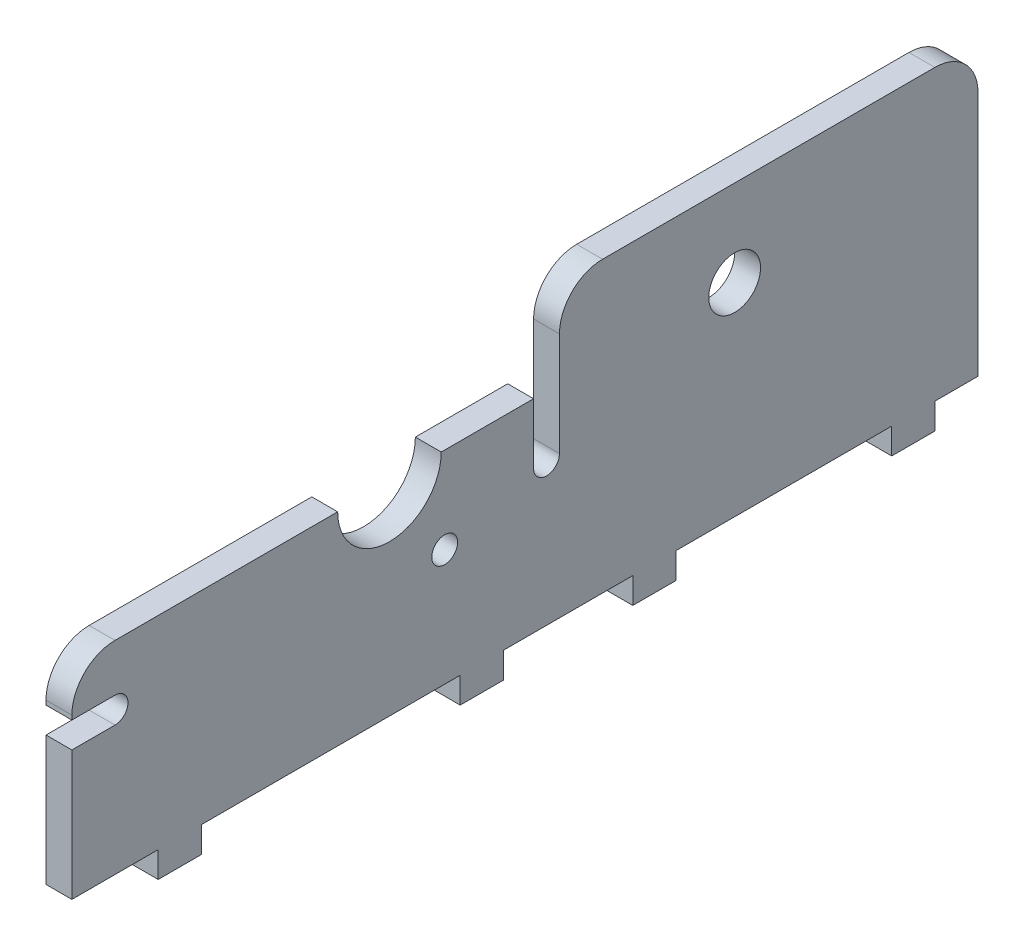
ISO-10303-21;
HEADER;
FILE_DESCRIPTION(('STEP AP214'),'2;1');
FILE_NAME('part.step','',(''),(''),'','','');
FILE_SCHEMA(('AUTOMOTIVE_DESIGN { 1 0 10303 214 1 1 1 1 }'));
ENDSEC;
DATA;
#1=APPLICATION_CONTEXT('core data for automotive mechanical design processes');
#2=APPLICATION_PROTOCOL_DEFINITION('international standard','automotive_design',2000,#1);
#3=PRODUCT_CONTEXT('',#1,'mechanical');
#4=PRODUCT('Part','Part','',(#3));
#5=PRODUCT_RELATED_PRODUCT_CATEGORY('part','',(#4));
#6=PRODUCT_DEFINITION_FORMATION('','',#4);
#7=PRODUCT_DEFINITION_CONTEXT('part definition',#1,'design');
#8=PRODUCT_DEFINITION('design','',#6,#7);
#9=PRODUCT_DEFINITION_SHAPE('','',#8);
#10=(LENGTH_UNIT() NAMED_UNIT(*) SI_UNIT(.MILLI.,.METRE.));
#11=(NAMED_UNIT(*) PLANE_ANGLE_UNIT() SI_UNIT($,.RADIAN.));
#12=(NAMED_UNIT(*) SI_UNIT($,.STERADIAN.) SOLID_ANGLE_UNIT());
#13=UNCERTAINTY_MEASURE_WITH_UNIT(LENGTH_MEASURE(1.E-05),#10,'distance_accuracy_value','');
#14=(GEOMETRIC_REPRESENTATION_CONTEXT(3) GLOBAL_UNCERTAINTY_ASSIGNED_CONTEXT((#13)) GLOBAL_UNIT_ASSIGNED_CONTEXT((#10,
#11,#12)) REPRESENTATION_CONTEXT('',''));
#15=CARTESIAN_POINT('',(0.,0.,0.));
#16=DIRECTION('',(0.,0.,1.));
#17=DIRECTION('',(1.,0.,0.));
#18=AXIS2_PLACEMENT_3D('',#15,#16,#17);
#19=CARTESIAN_POINT('',(3.,0.,-75.));
#20=DIRECTION('',(0.,1.,0.));
#21=DIRECTION('',(0.,0.,1.));
#22=AXIS2_PLACEMENT_3D('',#19,#20,#21);
#23=PLANE('',#22);
#24=DIRECTION('',(1.,0.,0.));
#25=VECTOR('',#24,1.);
#26=CARTESIAN_POINT('',(0.,0.,-70.));
#27=LINE('',#26,#25);
#28=CARTESIAN_POINT('',(0.,0.,-70.));
#29=VERTEX_POINT('',#28);
#30=CARTESIAN_POINT('',(3.,0.,-70.));
#31=VERTEX_POINT('',#30);
#32=EDGE_CURVE('E547',#29,#31,#27,.T.);
#33=ORIENTED_EDGE('',*,*,#32,.F.);
#34=DIRECTION('',(0.,0.,-1.));
#35=VECTOR('',#34,1.);
#36=CARTESIAN_POINT('',(0.,0.,-75.));
#37=LINE('',#36,#35);
#38=CARTESIAN_POINT('',(0.,0.,-75.));
#39=VERTEX_POINT('',#38);
#40=EDGE_CURVE('E279',#29,#39,#37,.T.);
#41=ORIENTED_EDGE('',*,*,#40,.T.);
#42=DIRECTION('',(-1.,0.,0.));
#43=VECTOR('',#42,1.);
#44=CARTESIAN_POINT('',(3.,0.,-75.));
#45=LINE('',#44,#43);
#46=CARTESIAN_POINT('',(3.,0.,-75.));
#47=VERTEX_POINT('',#46);
#48=EDGE_CURVE('E449',#47,#39,#45,.T.);
#49=ORIENTED_EDGE('',*,*,#48,.F.);
#50=DIRECTION('',(0.,0.,-1.));
#51=VECTOR('',#50,1.);
#52=CARTESIAN_POINT('',(3.,0.,-75.));
#53=LINE('',#52,#51);
#54=EDGE_CURVE('E437',#31,#47,#53,.T.);
#55=ORIENTED_EDGE('',*,*,#54,.F.);
#56=EDGE_LOOP('',(#33,#41,#49,#55));
#57=FACE_BOUND('',#56,.T.);
#58=ADVANCED_FACE('F39',(#57),#23,.F.);
#59=DIRECTION('',(-1.,0.,0.));
#60=VECTOR('',#59,1.);
#61=CARTESIAN_POINT('',(0.,0.,-65.));
#62=LINE('',#61,#60);
#63=CARTESIAN_POINT('',(3.,0.,-65.));
#64=VERTEX_POINT('',#63);
#65=CARTESIAN_POINT('',(0.,0.,-65.));
#66=VERTEX_POINT('',#65);
#67=EDGE_CURVE('E274',#64,#66,#62,.T.);
#68=ORIENTED_EDGE('',*,*,#67,.F.);
#69=CARTESIAN_POINT('',(3.,0.,-40.));
#70=VERTEX_POINT('',#69);
#71=EDGE_CURVE('E577',#70,#64,#53,.T.);
#72=ORIENTED_EDGE('',*,*,#71,.F.);
#73=DIRECTION('',(1.,0.,0.));
#74=VECTOR('',#73,1.);
#75=CARTESIAN_POINT('',(0.,0.,-40.));
#76=LINE('',#75,#74);
#77=CARTESIAN_POINT('',(0.,0.,-40.));
#78=VERTEX_POINT('',#77);
#79=EDGE_CURVE('E281',#78,#70,#76,.T.);
#80=ORIENTED_EDGE('',*,*,#79,.F.);
#81=EDGE_CURVE('E539',#78,#66,#37,.T.);
#82=ORIENTED_EDGE('',*,*,#81,.T.);
#83=EDGE_LOOP('',(#68,#72,#80,#82));
#84=FACE_BOUND('',#83,.T.);
#85=ADVANCED_FACE('F594',(#84),#23,.F.);
#86=DIRECTION('',(-1.,0.,0.));
#87=VECTOR('',#86,1.);
#88=CARTESIAN_POINT('',(0.,0.,-35.));
#89=LINE('',#88,#87);
#90=CARTESIAN_POINT('',(3.,0.,-35.));
#91=VERTEX_POINT('',#90);
#92=CARTESIAN_POINT('',(0.,0.,-35.));
#93=VERTEX_POINT('',#92);
#94=EDGE_CURVE('E284',#91,#93,#89,.T.);
#95=ORIENTED_EDGE('',*,*,#94,.F.);
#96=CARTESIAN_POINT('',(3.,0.,-20.));
#97=VERTEX_POINT('',#96);
#98=EDGE_CURVE('E580',#97,#91,#53,.T.);
#99=ORIENTED_EDGE('',*,*,#98,.F.);
#100=DIRECTION('',(-1.,0.,0.));
#101=VECTOR('',#100,1.);
#102=CARTESIAN_POINT('',(3.,0.,-20.));
#103=LINE('',#102,#101);
#104=CARTESIAN_POINT('',(0.,0.,-20.));
#105=VERTEX_POINT('',#104);
#106=EDGE_CURVE('E341',#97,#105,#103,.T.);
#107=ORIENTED_EDGE('',*,*,#106,.T.);
#108=EDGE_CURVE('E538',#105,#93,#37,.T.);
#109=ORIENTED_EDGE('',*,*,#108,.T.);
#110=EDGE_LOOP('',(#95,#99,#107,#109));
#111=FACE_BOUND('',#110,.T.);
#112=ADVANCED_FACE('F596',(#111),#23,.F.);
#113=CARTESIAN_POINT('',(3.,23.5,-75.));
#114=DIRECTION('',(0.,-1.,0.));
#115=DIRECTION('',(0.,0.,-1.));
#116=AXIS2_PLACEMENT_3D('',#113,#114,#115);
#117=PLANE('',#116);
#118=DIRECTION('',(0.,0.,1.));
#119=VECTOR('',#118,1.);
#120=CARTESIAN_POINT('',(3.,23.5,-75.));
#121=LINE('',#120,#119);
#122=CARTESIAN_POINT('',(3.,23.5,-23.5));
#123=VERTEX_POINT('',#122);
#124=CARTESIAN_POINT('',(3.,23.5,-12.8));
#125=VERTEX_POINT('',#124);
#126=EDGE_CURVE('E447',#123,#125,#121,.T.);
#127=ORIENTED_EDGE('',*,*,#126,.F.);
#128=DIRECTION('',(1.,0.,0.));
#129=VECTOR('',#128,1.);
#130=CARTESIAN_POINT('',(0.,23.5,-23.5));
#131=LINE('',#130,#129);
#132=CARTESIAN_POINT('',(0.,23.5,-23.5));
#133=VERTEX_POINT('',#132);
#134=EDGE_CURVE('E334',#133,#123,#131,.T.);
#135=ORIENTED_EDGE('',*,*,#134,.F.);
#136=DIRECTION('',(0.,0.,1.));
#137=VECTOR('',#136,1.);
#138=CARTESIAN_POINT('',(0.,23.5,-75.));
#139=LINE('',#138,#137);
#140=CARTESIAN_POINT('',(0.,23.5,-12.8));
#141=VERTEX_POINT('',#140);
#142=EDGE_CURVE('E459',#133,#141,#139,.T.);
#143=ORIENTED_EDGE('',*,*,#142,.T.);
#144=DIRECTION('',(1.,0.,0.));
#145=VECTOR('',#144,1.);
#146=CARTESIAN_POINT('',(0.,23.5,-12.8));
#147=LINE('',#146,#145);
#148=EDGE_CURVE('E431',#141,#125,#147,.T.);
#149=ORIENTED_EDGE('',*,*,#148,.T.);
#150=EDGE_LOOP('',(#127,#135,#143,#149));
#151=FACE_BOUND('',#150,.T.);
#152=ADVANCED_FACE('F602',(#151),#117,.F.);
#153=CARTESIAN_POINT('',(0.,0.,15.));
#154=VERTEX_POINT('',#153);
#155=CARTESIAN_POINT('',(0.,0.,-15.));
#156=VERTEX_POINT('',#155);
#157=EDGE_CURVE('E455',#154,#156,#37,.T.);
#158=ORIENTED_EDGE('',*,*,#157,.T.);
#159=DIRECTION('',(1.,0.,0.));
#160=VECTOR('',#159,1.);
#161=CARTESIAN_POINT('',(3.,0.,-15.));
#162=LINE('',#161,#160);
#163=CARTESIAN_POINT('',(3.,0.,-15.));
#164=VERTEX_POINT('',#163);
#165=EDGE_CURVE('E333',#156,#164,#162,.T.);
#166=ORIENTED_EDGE('',*,*,#165,.T.);
#167=CARTESIAN_POINT('',(3.,0.,15.));
#168=VERTEX_POINT('',#167);
#169=EDGE_CURVE('E443',#168,#164,#53,.T.);
#170=ORIENTED_EDGE('',*,*,#169,.F.);
#171=DIRECTION('',(1.,0.,0.));
#172=VECTOR('',#171,1.);
#173=CARTESIAN_POINT('',(3.,0.,15.));
#174=LINE('',#173,#172);
#175=EDGE_CURVE('E370',#154,#168,#174,.T.);
#176=ORIENTED_EDGE('',*,*,#175,.F.);
#177=EDGE_LOOP('',(#158,#166,#170,#176));
#178=FACE_BOUND('',#177,.T.);
#179=ADVANCED_FACE('F536',(#178),#23,.F.);
#180=DIRECTION('',(-1.,0.,0.));
#181=VECTOR('',#180,1.);
#182=CARTESIAN_POINT('',(3.,0.,20.));
#183=LINE('',#182,#181);
#184=CARTESIAN_POINT('',(3.,0.,20.));
#185=VERTEX_POINT('',#184);
#186=CARTESIAN_POINT('',(0.,0.,20.));
#187=VERTEX_POINT('',#186);
#188=EDGE_CURVE('E365',#185,#187,#183,.T.);
#189=ORIENTED_EDGE('',*,*,#188,.F.);
#190=CARTESIAN_POINT('',(3.,0.,30.));
#191=VERTEX_POINT('',#190);
#192=EDGE_CURVE('E439',#191,#185,#53,.T.);
#193=ORIENTED_EDGE('',*,*,#192,.F.);
#194=DIRECTION('',(-1.,0.,0.));
#195=VECTOR('',#194,1.);
#196=CARTESIAN_POINT('',(3.,0.,30.));
#197=LINE('',#196,#195);
#198=CARTESIAN_POINT('',(0.,0.,30.));
#199=VERTEX_POINT('',#198);
#200=EDGE_CURVE('E463',#191,#199,#197,.T.);
#201=ORIENTED_EDGE('',*,*,#200,.T.);
#202=EDGE_CURVE('E452',#199,#187,#37,.T.);
#203=ORIENTED_EDGE('',*,*,#202,.T.);
#204=EDGE_LOOP('',(#189,#193,#201,#203));
#205=FACE_BOUND('',#204,.T.);
#206=ADVANCED_FACE('F521',(#205),#23,.F.);
#207=CARTESIAN_POINT('',(3.,0.,30.));
#208=DIRECTION('',(0.,0.,-1.));
#209=DIRECTION('',(-1.,0.,0.));
#210=AXIS2_PLACEMENT_3D('',#207,#208,#209);
#211=PLANE('',#210);
#212=DIRECTION('',(0.,-1.,0.));
#213=VECTOR('',#212,1.);
#214=CARTESIAN_POINT('',(3.,0.,30.));
#215=LINE('',#214,#213);
#216=CARTESIAN_POINT('',(3.,15.,30.));
#217=VERTEX_POINT('',#216);
#218=EDGE_CURVE('E438',#217,#191,#215,.T.);
#219=ORIENTED_EDGE('',*,*,#218,.F.);
#220=DIRECTION('',(1.,0.,0.));
#221=VECTOR('',#220,1.);
#222=CARTESIAN_POINT('',(0.,15.,30.));
#223=LINE('',#222,#221);
#224=CARTESIAN_POINT('',(0.,15.,30.));
#225=VERTEX_POINT('',#224);
#226=EDGE_CURVE('E414',#225,#217,#223,.T.);
#227=ORIENTED_EDGE('',*,*,#226,.F.);
#228=DIRECTION('',(0.,-1.,0.));
#229=VECTOR('',#228,1.);
#230=CARTESIAN_POINT('',(0.,0.,30.));
#231=LINE('',#230,#229);
#232=EDGE_CURVE('E434',#225,#199,#231,.T.);
#233=ORIENTED_EDGE('',*,*,#232,.T.);
#234=ORIENTED_EDGE('',*,*,#200,.F.);
#235=EDGE_LOOP('',(#219,#227,#233,#234));
#236=FACE_BOUND('',#235,.T.);
#237=ADVANCED_FACE('F514',(#236),#211,.F.);
#238=CARTESIAN_POINT('',(3.,18.5,30.));
#239=VERTEX_POINT('',#238);
#240=CARTESIAN_POINT('',(3.,18.,30.));
#241=VERTEX_POINT('',#240);
#242=EDGE_CURVE('E435',#239,#241,#215,.T.);
#243=ORIENTED_EDGE('',*,*,#242,.F.);
#244=DIRECTION('',(-1.,0.,0.));
#245=VECTOR('',#244,1.);
#246=CARTESIAN_POINT('',(3.,18.5,30.));
#247=LINE('',#246,#245);
#248=CARTESIAN_POINT('',(0.,18.5,30.));
#249=VERTEX_POINT('',#248);
#250=EDGE_CURVE('E47',#239,#249,#247,.T.);
#251=ORIENTED_EDGE('',*,*,#250,.T.);
#252=CARTESIAN_POINT('',(0.,18.,30.));
#253=VERTEX_POINT('',#252);
#254=EDGE_CURVE('E450',#249,#253,#231,.T.);
#255=ORIENTED_EDGE('',*,*,#254,.T.);
#256=DIRECTION('',(1.,0.,0.));
#257=VECTOR('',#256,1.);
#258=CARTESIAN_POINT('',(0.,18.,30.));
#259=LINE('',#258,#257);
#260=EDGE_CURVE('E416',#253,#241,#259,.T.);
#261=ORIENTED_EDGE('',*,*,#260,.T.);
#262=EDGE_LOOP('',(#243,#251,#255,#261));
#263=FACE_BOUND('',#262,.T.);
#264=ADVANCED_FACE('F492',(#263),#211,.F.);
#265=CARTESIAN_POINT('',(3.,0.,-75.));
#266=DIRECTION('',(0.,0.,1.));
#267=DIRECTION('',(1.,0.,0.));
#268=AXIS2_PLACEMENT_3D('',#265,#266,#267);
#269=PLANE('',#268);
#270=DIRECTION('',(0.,1.,0.));
#271=VECTOR('',#270,1.);
#272=CARTESIAN_POINT('',(0.,0.,-75.));
#273=LINE('',#272,#271);
#274=CARTESIAN_POINT('',(0.,28.5,-75.));
#275=VERTEX_POINT('',#274);
#276=EDGE_CURVE('E454',#39,#275,#273,.T.);
#277=ORIENTED_EDGE('',*,*,#276,.T.);
#278=DIRECTION('',(-1.,0.,0.));
#279=VECTOR('',#278,1.);
#280=CARTESIAN_POINT('',(3.,28.5,-75.));
#281=LINE('',#280,#279);
#282=CARTESIAN_POINT('',(3.,28.5,-75.));
#283=VERTEX_POINT('',#282);
#284=EDGE_CURVE('E481',#275,#283,#281,.F.);
#285=ORIENTED_EDGE('',*,*,#284,.T.);
#286=DIRECTION('',(0.,1.,0.));
#287=VECTOR('',#286,1.);
#288=CARTESIAN_POINT('',(3.,0.,-75.));
#289=LINE('',#288,#287);
#290=EDGE_CURVE('E442',#47,#283,#289,.T.);
#291=ORIENTED_EDGE('',*,*,#290,.F.);
#292=ORIENTED_EDGE('',*,*,#48,.T.);
#293=EDGE_LOOP('',(#277,#285,#291,#292));
#294=FACE_BOUND('',#293,.T.);
#295=ADVANCED_FACE('F549',(#294),#269,.F.);
#296=CARTESIAN_POINT('',(0.,23.5,-0.799999999999991));
#297=VERTEX_POINT('',#296);
#298=CARTESIAN_POINT('',(0.,23.5,25.));
#299=VERTEX_POINT('',#298);
#300=EDGE_CURVE('E458',#297,#299,#139,.T.);
#301=ORIENTED_EDGE('',*,*,#300,.T.);
#302=DIRECTION('',(-1.,0.,0.));
#303=VECTOR('',#302,1.);
#304=CARTESIAN_POINT('',(3.,23.5,25.));
#305=LINE('',#304,#303);
#306=CARTESIAN_POINT('',(3.,23.5,25.));
#307=VERTEX_POINT('',#306);
#308=EDGE_CURVE('E11',#299,#307,#305,.F.);
#309=ORIENTED_EDGE('',*,*,#308,.T.);
#310=CARTESIAN_POINT('',(3.,23.5,-0.799999999999991));
#311=VERTEX_POINT('',#310);
#312=EDGE_CURVE('E446',#311,#307,#121,.T.);
#313=ORIENTED_EDGE('',*,*,#312,.F.);
#314=DIRECTION('',(1.,0.,0.));
#315=VECTOR('',#314,1.);
#316=CARTESIAN_POINT('',(0.,23.5,-0.799999999999991));
#317=LINE('',#316,#315);
#318=EDGE_CURVE('E423',#311,#297,#317,.F.);
#319=ORIENTED_EDGE('',*,*,#318,.T.);
#320=EDGE_LOOP('',(#301,#309,#313,#319));
#321=FACE_BOUND('',#320,.T.);
#322=ADVANCED_FACE('F638',(#321),#117,.F.);
#323=CARTESIAN_POINT('',(3.,0.,0.));
#324=DIRECTION('',(1.,0.,0.));
#325=DIRECTION('',(0.,0.,-1.));
#326=AXIS2_PLACEMENT_3D('',#323,#324,#325);
#327=PLANE('',#326);
#328=CARTESIAN_POINT('',(3.,23.5,-46.8));
#329=DIRECTION('',(1.,0.,0.));
#330=DIRECTION('',(0.,0.,-1.));
#331=AXIS2_PLACEMENT_3D('',#328,#329,#330);
#332=CIRCLE('',#331,3.);
#333=CARTESIAN_POINT('',(3.,23.5,-49.8));
#334=VERTEX_POINT('',#333);
#335=EDGE_CURVE('E988',#334,#334,#332,.T.);
#336=ORIENTED_EDGE('',*,*,#335,.F.);
#337=EDGE_LOOP('',(#336));
#338=FACE_BOUND('',#337,.T.);
#339=ORIENTED_EDGE('',*,*,#290,.T.);
#340=CARTESIAN_POINT('',(3.,28.5,-70.));
#341=DIRECTION('',(1.,0.,0.));
#342=DIRECTION('',(0.,0.,-1.));
#343=AXIS2_PLACEMENT_3D('',#340,#341,#342);
#344=CIRCLE('',#343,5.);
#345=CARTESIAN_POINT('',(3.,33.5,-70.));
#346=VERTEX_POINT('',#345);
#347=EDGE_CURVE('E485',#283,#346,#344,.T.);
#348=ORIENTED_EDGE('',*,*,#347,.T.);
#349=DIRECTION('',(0.,0.,-1.));
#350=VECTOR('',#349,1.);
#351=CARTESIAN_POINT('',(3.,33.5,-26.5));
#352=LINE('',#351,#350);
#353=CARTESIAN_POINT('',(3.,33.5,-31.5));
#354=VERTEX_POINT('',#353);
#355=EDGE_CURVE('E561',#354,#346,#352,.T.);
#356=ORIENTED_EDGE('',*,*,#355,.F.);
#357=CARTESIAN_POINT('',(3.,28.5,-31.5));
#358=DIRECTION('',(1.,0.,0.));
#359=DIRECTION('',(0.,0.,-1.));
#360=AXIS2_PLACEMENT_3D('',#357,#358,#359);
#361=CIRCLE('',#360,5.);
#362=CARTESIAN_POINT('',(3.,28.5,-26.5));
#363=VERTEX_POINT('',#362);
#364=EDGE_CURVE('E54',#354,#363,#361,.T.);
#365=ORIENTED_EDGE('',*,*,#364,.T.);
#366=DIRECTION('',(0.,1.,0.));
#367=VECTOR('',#366,1.);
#368=CARTESIAN_POINT('',(3.,23.5,-26.5));
#369=LINE('',#368,#367);
#370=CARTESIAN_POINT('',(3.,16.5,-26.5));
#371=VERTEX_POINT('',#370);
#372=EDGE_CURVE('E327',#371,#363,#369,.T.);
#373=ORIENTED_EDGE('',*,*,#372,.F.);
#374=CARTESIAN_POINT('',(3.,16.5,-25.));
#375=DIRECTION('',(1.,0.,0.));
#376=DIRECTION('',(0.,0.,-1.));
#377=AXIS2_PLACEMENT_3D('',#374,#375,#376);
#378=CIRCLE('',#377,1.5);
#379=CARTESIAN_POINT('',(3.,16.5,-23.5));
#380=VERTEX_POINT('',#379);
#381=EDGE_CURVE('E313',#380,#371,#378,.T.);
#382=ORIENTED_EDGE('',*,*,#381,.F.);
#383=DIRECTION('',(0.,-1.,0.));
#384=VECTOR('',#383,1.);
#385=CARTESIAN_POINT('',(3.,16.5,-23.5));
#386=LINE('',#385,#384);
#387=EDGE_CURVE('E318',#123,#380,#386,.T.);
#388=ORIENTED_EDGE('',*,*,#387,.F.);
#389=ORIENTED_EDGE('',*,*,#126,.T.);
#390=CARTESIAN_POINT('',(3.,23.5,-6.79999999999999));
#391=DIRECTION('',(1.,0.,0.));
#392=DIRECTION('',(0.,0.,-1.));
#393=AXIS2_PLACEMENT_3D('',#390,#391,#392);
#394=CIRCLE('',#393,6.);
#395=EDGE_CURVE('E420',#311,#125,#394,.T.);
#396=ORIENTED_EDGE('',*,*,#395,.F.);
#397=ORIENTED_EDGE('',*,*,#312,.T.);
#398=CARTESIAN_POINT('',(3.,18.5,25.));
#399=DIRECTION('',(1.,0.,0.));
#400=DIRECTION('',(0.,0.,-1.));
#401=AXIS2_PLACEMENT_3D('',#398,#399,#400);
#402=CIRCLE('',#401,5.);
#403=EDGE_CURVE('E61',#307,#239,#402,.T.);
#404=ORIENTED_EDGE('',*,*,#403,.T.);
#405=ORIENTED_EDGE('',*,*,#242,.T.);
#406=DIRECTION('',(0.,0.,1.));
#407=VECTOR('',#406,1.);
#408=CARTESIAN_POINT('',(3.,18.,25.));
#409=LINE('',#408,#407);
#410=CARTESIAN_POINT('',(3.,18.,25.));
#411=VERTEX_POINT('',#410);
#412=EDGE_CURVE('E406',#411,#241,#409,.T.);
#413=ORIENTED_EDGE('',*,*,#412,.F.);
#414=CARTESIAN_POINT('',(3.,16.5,25.));
#415=DIRECTION('',(1.,0.,0.));
#416=DIRECTION('',(0.,0.,-1.));
#417=AXIS2_PLACEMENT_3D('',#414,#415,#416);
#418=CIRCLE('',#417,1.5);
#419=CARTESIAN_POINT('',(3.,15.,25.));
#420=VERTEX_POINT('',#419);
#421=EDGE_CURVE('E392',#420,#411,#418,.T.);
#422=ORIENTED_EDGE('',*,*,#421,.F.);
#423=DIRECTION('',(0.,0.,-1.));
#424=VECTOR('',#423,1.);
#425=CARTESIAN_POINT('',(3.,15.,25.));
#426=LINE('',#425,#424);
#427=EDGE_CURVE('E397',#217,#420,#426,.T.);
#428=ORIENTED_EDGE('',*,*,#427,.F.);
#429=ORIENTED_EDGE('',*,*,#218,.T.);
#430=ORIENTED_EDGE('',*,*,#192,.T.);
#431=DIRECTION('',(0.,1.,0.));
#432=VECTOR('',#431,1.);
#433=CARTESIAN_POINT('',(3.,-3.,20.));
#434=LINE('',#433,#432);
#435=CARTESIAN_POINT('',(3.,-3.,20.));
#436=VERTEX_POINT('',#435);
#437=EDGE_CURVE('E389',#436,#185,#434,.T.);
#438=ORIENTED_EDGE('',*,*,#437,.F.);
#439=DIRECTION('',(0.,0.,1.));
#440=VECTOR('',#439,1.);
#441=CARTESIAN_POINT('',(3.,-3.,20.));
#442=LINE('',#441,#440);
#443=CARTESIAN_POINT('',(3.,-3.,15.));
#444=VERTEX_POINT('',#443);
#445=EDGE_CURVE('E366',#444,#436,#442,.T.);
#446=ORIENTED_EDGE('',*,*,#445,.F.);
#447=DIRECTION('',(0.,1.,0.));
#448=VECTOR('',#447,1.);
#449=CARTESIAN_POINT('',(3.,-3.,15.));
#450=LINE('',#449,#448);
#451=EDGE_CURVE('E376',#444,#168,#450,.T.);
#452=ORIENTED_EDGE('',*,*,#451,.T.);
#453=ORIENTED_EDGE('',*,*,#169,.T.);
#454=DIRECTION('',(0.,1.,0.));
#455=VECTOR('',#454,1.);
#456=CARTESIAN_POINT('',(3.,-3.,-15.));
#457=LINE('',#456,#455);
#458=CARTESIAN_POINT('',(3.,-3.,-15.));
#459=VERTEX_POINT('',#458);
#460=EDGE_CURVE('E362',#459,#164,#457,.T.);
#461=ORIENTED_EDGE('',*,*,#460,.F.);
#462=DIRECTION('',(0.,0.,-1.));
#463=VECTOR('',#462,1.);
#464=CARTESIAN_POINT('',(3.,-3.,-20.));
#465=LINE('',#464,#463);
#466=CARTESIAN_POINT('',(3.,-3.,-20.));
#467=VERTEX_POINT('',#466);
#468=EDGE_CURVE('E337',#459,#467,#465,.T.);
#469=ORIENTED_EDGE('',*,*,#468,.T.);
#470=DIRECTION('',(0.,1.,0.));
#471=VECTOR('',#470,1.);
#472=CARTESIAN_POINT('',(3.,-3.,-20.));
#473=LINE('',#472,#471);
#474=EDGE_CURVE('E350',#467,#97,#473,.T.);
#475=ORIENTED_EDGE('',*,*,#474,.T.);
#476=ORIENTED_EDGE('',*,*,#98,.T.);
#477=DIRECTION('',(0.,1.,0.));
#478=VECTOR('',#477,1.);
#479=CARTESIAN_POINT('',(3.,-3.,-35.));
#480=LINE('',#479,#478);
#481=CARTESIAN_POINT('',(3.,-3.,-35.));
#482=VERTEX_POINT('',#481);
#483=EDGE_CURVE('E304',#482,#91,#480,.T.);
#484=ORIENTED_EDGE('',*,*,#483,.F.);
#485=DIRECTION('',(0.,0.,1.));
#486=VECTOR('',#485,1.);
#487=CARTESIAN_POINT('',(3.,-3.,-35.));
#488=LINE('',#487,#486);
#489=CARTESIAN_POINT('',(3.,-3.,-40.));
#490=VERTEX_POINT('',#489);
#491=EDGE_CURVE('E295',#490,#482,#488,.T.);
#492=ORIENTED_EDGE('',*,*,#491,.F.);
#493=DIRECTION('',(0.,1.,0.));
#494=VECTOR('',#493,1.);
#495=CARTESIAN_POINT('',(3.,-3.,-40.));
#496=LINE('',#495,#494);
#497=EDGE_CURVE('E307',#490,#70,#496,.T.);
#498=ORIENTED_EDGE('',*,*,#497,.T.);
#499=ORIENTED_EDGE('',*,*,#71,.T.);
#500=DIRECTION('',(0.,1.,0.));
#501=VECTOR('',#500,1.);
#502=CARTESIAN_POINT('',(3.,-3.,-65.));
#503=LINE('',#502,#501);
#504=CARTESIAN_POINT('',(3.,-3.,-65.));
#505=VERTEX_POINT('',#504);
#506=EDGE_CURVE('E286',#505,#64,#503,.T.);
#507=ORIENTED_EDGE('',*,*,#506,.F.);
#508=DIRECTION('',(0.,0.,1.));
#509=VECTOR('',#508,1.);
#510=CARTESIAN_POINT('',(3.,-3.,-65.));
#511=LINE('',#510,#509);
#512=CARTESIAN_POINT('',(3.,-3.,-70.));
#513=VERTEX_POINT('',#512);
#514=EDGE_CURVE('E264',#513,#505,#511,.T.);
#515=ORIENTED_EDGE('',*,*,#514,.F.);
#516=DIRECTION('',(0.,1.,0.));
#517=VECTOR('',#516,1.);
#518=CARTESIAN_POINT('',(3.,-3.,-70.));
#519=LINE('',#518,#517);
#520=EDGE_CURVE('E261',#513,#31,#519,.T.);
#521=ORIENTED_EDGE('',*,*,#520,.T.);
#522=ORIENTED_EDGE('',*,*,#54,.T.);
#523=EDGE_LOOP('',(#339,#348,#356,#365,#373,#382,#388,#389,#396,#397,#404,#405,#413,#422,#428,
#429,#430,#438,#446,#452,#453,#461,#469,#475,#476,#484,#492,#498,#499,#507,#515,#521,#522));
#524=FACE_BOUND('',#523,.T.);
#525=CARTESIAN_POINT('',(3.,13.5,-13.2));
#526=DIRECTION('',(1.,0.,0.));
#527=DIRECTION('',(0.,0.,-1.));
#528=AXIS2_PLACEMENT_3D('',#525,#526,#527);
#529=CIRCLE('',#528,1.5);
#530=CARTESIAN_POINT('',(3.,13.5,-14.7));
#531=VERTEX_POINT('',#530);
#532=EDGE_CURVE('E413',#531,#531,#529,.T.);
#533=ORIENTED_EDGE('',*,*,#532,.F.);
#534=EDGE_LOOP('',(#533));
#535=FACE_BOUND('',#534,.T.);
#536=ADVANCED_FACE('F503',(#338,#524,#535),#327,.T.);
#537=CARTESIAN_POINT('',(0.,0.,0.));
#538=DIRECTION('',(1.,0.,0.));
#539=DIRECTION('',(0.,0.,-1.));
#540=AXIS2_PLACEMENT_3D('',#537,#538,#539);
#541=PLANE('',#540);
#542=CARTESIAN_POINT('',(0.,23.5,-46.8));
#543=DIRECTION('',(1.,0.,0.));
#544=DIRECTION('',(0.,0.,-1.));
#545=AXIS2_PLACEMENT_3D('',#542,#543,#544);
#546=CIRCLE('',#545,3.);
#547=CARTESIAN_POINT('',(0.,23.5,-49.8));
#548=VERTEX_POINT('',#547);
#549=EDGE_CURVE('E564',#548,#548,#546,.T.);
#550=ORIENTED_EDGE('',*,*,#549,.T.);
#551=EDGE_LOOP('',(#550));
#552=FACE_BOUND('',#551,.T.);
#553=CARTESIAN_POINT('',(0.,13.5,-13.2));
#554=DIRECTION('',(1.,0.,0.));
#555=DIRECTION('',(0.,0.,-1.));
#556=AXIS2_PLACEMENT_3D('',#553,#554,#555);
#557=CIRCLE('',#556,1.5);
#558=CARTESIAN_POINT('',(0.,13.5,-14.7));
#559=VERTEX_POINT('',#558);
#560=EDGE_CURVE('E424',#559,#559,#557,.T.);
#561=ORIENTED_EDGE('',*,*,#560,.T.);
#562=EDGE_LOOP('',(#561));
#563=FACE_BOUND('',#562,.T.);
#564=DIRECTION('',(0.,0.,1.));
#565=VECTOR('',#564,1.);
#566=CARTESIAN_POINT('',(0.,33.5,-26.5));
#567=LINE('',#566,#565);
#568=CARTESIAN_POINT('',(0.,33.5,-70.));
#569=VERTEX_POINT('',#568);
#570=CARTESIAN_POINT('',(0.,33.5,-31.5));
#571=VERTEX_POINT('',#570);
#572=EDGE_CURVE('E552',#569,#571,#567,.T.);
#573=ORIENTED_EDGE('',*,*,#572,.F.);
#574=CARTESIAN_POINT('',(0.,28.5,-70.));
#575=DIRECTION('',(1.,0.,0.));
#576=DIRECTION('',(0.,0.,-1.));
#577=AXIS2_PLACEMENT_3D('',#574,#575,#576);
#578=CIRCLE('',#577,5.);
#579=EDGE_CURVE('E479',#569,#275,#578,.F.);
#580=ORIENTED_EDGE('',*,*,#579,.T.);
#581=ORIENTED_EDGE('',*,*,#276,.F.);
#582=ORIENTED_EDGE('',*,*,#40,.F.);
#583=DIRECTION('',(0.,1.,0.));
#584=VECTOR('',#583,1.);
#585=CARTESIAN_POINT('',(0.,-3.,-70.));
#586=LINE('',#585,#584);
#587=CARTESIAN_POINT('',(0.,-3.,-70.));
#588=VERTEX_POINT('',#587);
#589=EDGE_CURVE('E259',#588,#29,#586,.T.);
#590=ORIENTED_EDGE('',*,*,#589,.F.);
#591=DIRECTION('',(0.,0.,-1.));
#592=VECTOR('',#591,1.);
#593=CARTESIAN_POINT('',(0.,-3.,-65.));
#594=LINE('',#593,#592);
#595=CARTESIAN_POINT('',(0.,-3.,-65.));
#596=VERTEX_POINT('',#595);
#597=EDGE_CURVE('E265',#596,#588,#594,.T.);
#598=ORIENTED_EDGE('',*,*,#597,.F.);
#599=DIRECTION('',(0.,1.,0.));
#600=VECTOR('',#599,1.);
#601=CARTESIAN_POINT('',(0.,-3.,-65.));
#602=LINE('',#601,#600);
#603=EDGE_CURVE('E569',#596,#66,#602,.T.);
#604=ORIENTED_EDGE('',*,*,#603,.T.);
#605=ORIENTED_EDGE('',*,*,#81,.F.);
#606=DIRECTION('',(0.,1.,0.));
#607=VECTOR('',#606,1.);
#608=CARTESIAN_POINT('',(0.,-3.,-40.));
#609=LINE('',#608,#607);
#610=CARTESIAN_POINT('',(0.,-3.,-40.));
#611=VERTEX_POINT('',#610);
#612=EDGE_CURVE('E310',#611,#78,#609,.T.);
#613=ORIENTED_EDGE('',*,*,#612,.F.);
#614=DIRECTION('',(0.,0.,-1.));
#615=VECTOR('',#614,1.);
#616=CARTESIAN_POINT('',(0.,-3.,-35.));
#617=LINE('',#616,#615);
#618=CARTESIAN_POINT('',(0.,-3.,-35.));
#619=VERTEX_POINT('',#618);
#620=EDGE_CURVE('E290',#619,#611,#617,.T.);
#621=ORIENTED_EDGE('',*,*,#620,.F.);
#622=DIRECTION('',(0.,1.,0.));
#623=VECTOR('',#622,1.);
#624=CARTESIAN_POINT('',(0.,-3.,-35.));
#625=LINE('',#624,#623);
#626=EDGE_CURVE('E298',#619,#93,#625,.T.);
#627=ORIENTED_EDGE('',*,*,#626,.T.);
#628=ORIENTED_EDGE('',*,*,#108,.F.);
#629=DIRECTION('',(0.,1.,0.));
#630=VECTOR('',#629,1.);
#631=CARTESIAN_POINT('',(0.,-3.,-20.));
#632=LINE('',#631,#630);
#633=CARTESIAN_POINT('',(0.,-3.,-20.));
#634=VERTEX_POINT('',#633);
#635=EDGE_CURVE('E356',#634,#105,#632,.T.);
#636=ORIENTED_EDGE('',*,*,#635,.F.);
#637=DIRECTION('',(0.,0.,1.));
#638=VECTOR('',#637,1.);
#639=CARTESIAN_POINT('',(0.,-3.,-20.));
#640=LINE('',#639,#638);
#641=CARTESIAN_POINT('',(0.,-3.,-15.));
#642=VERTEX_POINT('',#641);
#643=EDGE_CURVE('E344',#634,#642,#640,.T.);
#644=ORIENTED_EDGE('',*,*,#643,.T.);
#645=DIRECTION('',(0.,1.,0.));
#646=VECTOR('',#645,1.);
#647=CARTESIAN_POINT('',(0.,-3.,-15.));
#648=LINE('',#647,#646);
#649=EDGE_CURVE('E359',#642,#156,#648,.T.);
#650=ORIENTED_EDGE('',*,*,#649,.T.);
#651=ORIENTED_EDGE('',*,*,#157,.F.);
#652=DIRECTION('',(0.,1.,0.));
#653=VECTOR('',#652,1.);
#654=CARTESIAN_POINT('',(0.,-3.,15.));
#655=LINE('',#654,#653);
#656=CARTESIAN_POINT('',(0.,-3.,15.));
#657=VERTEX_POINT('',#656);
#658=EDGE_CURVE('E383',#657,#154,#655,.T.);
#659=ORIENTED_EDGE('',*,*,#658,.F.);
#660=DIRECTION('',(0.,0.,-1.));
#661=VECTOR('',#660,1.);
#662=CARTESIAN_POINT('',(0.,-3.,20.));
#663=LINE('',#662,#661);
#664=CARTESIAN_POINT('',(0.,-3.,20.));
#665=VERTEX_POINT('',#664);
#666=EDGE_CURVE('E372',#665,#657,#663,.T.);
#667=ORIENTED_EDGE('',*,*,#666,.F.);
#668=DIRECTION('',(0.,1.,0.));
#669=VECTOR('',#668,1.);
#670=CARTESIAN_POINT('',(0.,-3.,20.));
#671=LINE('',#670,#669);
#672=EDGE_CURVE('E386',#665,#187,#671,.T.);
#673=ORIENTED_EDGE('',*,*,#672,.T.);
#674=ORIENTED_EDGE('',*,*,#202,.F.);
#675=ORIENTED_EDGE('',*,*,#232,.F.);
#676=DIRECTION('',(0.,0.,-1.));
#677=VECTOR('',#676,1.);
#678=CARTESIAN_POINT('',(0.,15.,25.));
#679=LINE('',#678,#677);
#680=CARTESIAN_POINT('',(0.,15.,25.));
#681=VERTEX_POINT('',#680);
#682=EDGE_CURVE('E400',#225,#681,#679,.T.);
#683=ORIENTED_EDGE('',*,*,#682,.T.);
#684=CARTESIAN_POINT('',(0.,16.5,25.));
#685=DIRECTION('',(1.,0.,0.));
#686=DIRECTION('',(0.,0.,-1.));
#687=AXIS2_PLACEMENT_3D('',#684,#685,#686);
#688=CIRCLE('',#687,1.5);
#689=CARTESIAN_POINT('',(0.,18.,25.));
#690=VERTEX_POINT('',#689);
#691=EDGE_CURVE('E393',#681,#690,#688,.T.);
#692=ORIENTED_EDGE('',*,*,#691,.T.);
#693=DIRECTION('',(0.,0.,1.));
#694=VECTOR('',#693,1.);
#695=CARTESIAN_POINT('',(0.,18.,25.));
#696=LINE('',#695,#694);
#697=EDGE_CURVE('E396',#690,#253,#696,.T.);
#698=ORIENTED_EDGE('',*,*,#697,.T.);
#699=ORIENTED_EDGE('',*,*,#254,.F.);
#700=CARTESIAN_POINT('',(0.,18.5,25.));
#701=DIRECTION('',(1.,0.,0.));
#702=DIRECTION('',(0.,0.,-1.));
#703=AXIS2_PLACEMENT_3D('',#700,#701,#702);
#704=CIRCLE('',#703,5.);
#705=EDGE_CURVE('E475',#249,#299,#704,.F.);
#706=ORIENTED_EDGE('',*,*,#705,.T.);
#707=ORIENTED_EDGE('',*,*,#300,.F.);
#708=CARTESIAN_POINT('',(0.,23.5,-6.79999999999999));
#709=DIRECTION('',(1.,0.,0.));
#710=DIRECTION('',(0.,0.,-1.));
#711=AXIS2_PLACEMENT_3D('',#708,#709,#710);
#712=CIRCLE('',#711,6.);
#713=EDGE_CURVE('E466',#297,#141,#712,.T.);
#714=ORIENTED_EDGE('',*,*,#713,.T.);
#715=ORIENTED_EDGE('',*,*,#142,.F.);
#716=DIRECTION('',(0.,-1.,0.));
#717=VECTOR('',#716,1.);
#718=CARTESIAN_POINT('',(0.,16.5,-23.5));
#719=LINE('',#718,#717);
#720=CARTESIAN_POINT('',(0.,16.5,-23.5));
#721=VERTEX_POINT('',#720);
#722=EDGE_CURVE('E321',#133,#721,#719,.T.);
#723=ORIENTED_EDGE('',*,*,#722,.T.);
#724=CARTESIAN_POINT('',(0.,16.5,-25.));
#725=DIRECTION('',(1.,0.,0.));
#726=DIRECTION('',(0.,0.,-1.));
#727=AXIS2_PLACEMENT_3D('',#724,#725,#726);
#728=CIRCLE('',#727,1.5);
#729=CARTESIAN_POINT('',(0.,16.5,-26.5));
#730=VERTEX_POINT('',#729);
#731=EDGE_CURVE('E314',#721,#730,#728,.T.);
#732=ORIENTED_EDGE('',*,*,#731,.T.);
#733=DIRECTION('',(0.,1.,0.));
#734=VECTOR('',#733,1.);
#735=CARTESIAN_POINT('',(0.,23.5,-26.5));
#736=LINE('',#735,#734);
#737=CARTESIAN_POINT('',(0.,28.5,-26.5));
#738=VERTEX_POINT('',#737);
#739=EDGE_CURVE('E317',#730,#738,#736,.T.);
#740=ORIENTED_EDGE('',*,*,#739,.T.);
#741=CARTESIAN_POINT('',(0.,28.5,-31.5));
#742=DIRECTION('',(1.,0.,0.));
#743=DIRECTION('',(0.,0.,-1.));
#744=AXIS2_PLACEMENT_3D('',#741,#742,#743);
#745=CIRCLE('',#744,5.);
#746=EDGE_CURVE('E477',#738,#571,#745,.F.);
#747=ORIENTED_EDGE('',*,*,#746,.T.);
#748=EDGE_LOOP('',(#573,#580,#581,#582,#590,#598,#604,#605,#613,#621,#627,#628,#636,#644,#650,
#651,#659,#667,#673,#674,#675,#683,#692,#698,#699,#706,#707,#714,#715,#723,#732,#740,#747));
#749=FACE_BOUND('',#748,.T.);
#750=ADVANCED_FACE('F277',(#552,#563,#749),#541,.F.);
#751=CARTESIAN_POINT('',(0.,13.5,-13.2));
#752=DIRECTION('',(1.,0.,0.));
#753=DIRECTION('',(0.,0.,-1.));
#754=AXIS2_PLACEMENT_3D('',#751,#752,#753);
#755=CYLINDRICAL_SURFACE('',#754,1.5);
#756=ORIENTED_EDGE('',*,*,#560,.F.);
#757=EDGE_LOOP('',(#756));
#758=FACE_BOUND('',#757,.T.);
#759=ORIENTED_EDGE('',*,*,#532,.T.);
#760=EDGE_LOOP('',(#759));
#761=FACE_BOUND('',#760,.T.);
#762=ADVANCED_FACE('F697',(#758,#761),#755,.F.);
#763=CARTESIAN_POINT('',(0.,23.5,-6.79999999999999));
#764=DIRECTION('',(1.,0.,0.));
#765=DIRECTION('',(0.,0.,-1.));
#766=AXIS2_PLACEMENT_3D('',#763,#764,#765);
#767=CYLINDRICAL_SURFACE('',#766,6.);
#768=ORIENTED_EDGE('',*,*,#713,.F.);
#769=ORIENTED_EDGE('',*,*,#318,.F.);
#770=ORIENTED_EDGE('',*,*,#395,.T.);
#771=ORIENTED_EDGE('',*,*,#148,.F.);
#772=EDGE_LOOP('',(#768,#769,#770,#771));
#773=FACE_BOUND('',#772,.T.);
#774=ADVANCED_FACE('F634',(#773),#767,.F.);
#775=CARTESIAN_POINT('',(0.,16.5,25.));
#776=DIRECTION('',(1.,0.,0.));
#777=DIRECTION('',(0.,0.,-1.));
#778=AXIS2_PLACEMENT_3D('',#775,#776,#777);
#779=CYLINDRICAL_SURFACE('',#778,1.5);
#780=ORIENTED_EDGE('',*,*,#421,.T.);
#781=DIRECTION('',(1.,0.,0.));
#782=VECTOR('',#781,1.);
#783=CARTESIAN_POINT('',(0.,18.,25.));
#784=LINE('',#783,#782);
#785=EDGE_CURVE('E403',#690,#411,#784,.T.);
#786=ORIENTED_EDGE('',*,*,#785,.F.);
#787=ORIENTED_EDGE('',*,*,#691,.F.);
#788=DIRECTION('',(1.,0.,0.));
#789=VECTOR('',#788,1.);
#790=CARTESIAN_POINT('',(0.,15.,25.));
#791=LINE('',#790,#789);
#792=EDGE_CURVE('E411',#681,#420,#791,.T.);
#793=ORIENTED_EDGE('',*,*,#792,.T.);
#794=EDGE_LOOP('',(#780,#786,#787,#793));
#795=FACE_BOUND('',#794,.T.);
#796=ADVANCED_FACE('F508',(#795),#779,.F.);
#797=CARTESIAN_POINT('',(0.,15.,25.));
#798=DIRECTION('',(0.,-1.,0.));
#799=DIRECTION('',(0.,0.,-1.));
#800=AXIS2_PLACEMENT_3D('',#797,#798,#799);
#801=PLANE('',#800);
#802=ORIENTED_EDGE('',*,*,#427,.T.);
#803=ORIENTED_EDGE('',*,*,#792,.F.);
#804=ORIENTED_EDGE('',*,*,#682,.F.);
#805=ORIENTED_EDGE('',*,*,#226,.T.);
#806=EDGE_LOOP('',(#802,#803,#804,#805));
#807=FACE_BOUND('',#806,.T.);
#808=ADVANCED_FACE('F510',(#807),#801,.F.);
#809=CARTESIAN_POINT('',(0.,18.,25.));
#810=DIRECTION('',(0.,1.,0.));
#811=DIRECTION('',(0.,0.,1.));
#812=AXIS2_PLACEMENT_3D('',#809,#810,#811);
#813=PLANE('',#812);
#814=ORIENTED_EDGE('',*,*,#412,.T.);
#815=ORIENTED_EDGE('',*,*,#260,.F.);
#816=ORIENTED_EDGE('',*,*,#697,.F.);
#817=ORIENTED_EDGE('',*,*,#785,.T.);
#818=EDGE_LOOP('',(#814,#815,#816,#817));
#819=FACE_BOUND('',#818,.T.);
#820=ADVANCED_FACE('F500',(#819),#813,.F.);
#821=CARTESIAN_POINT('',(3.,-3.,20.));
#822=DIRECTION('',(0.,0.,-1.));
#823=DIRECTION('',(0.,1.,0.));
#824=AXIS2_PLACEMENT_3D('',#821,#822,#823);
#825=PLANE('',#824);
#826=ORIENTED_EDGE('',*,*,#188,.T.);
#827=ORIENTED_EDGE('',*,*,#672,.F.);
#828=DIRECTION('',(-1.,0.,0.));
#829=VECTOR('',#828,1.);
#830=CARTESIAN_POINT('',(3.,-3.,20.));
#831=LINE('',#830,#829);
#832=EDGE_CURVE('E369',#436,#665,#831,.T.);
#833=ORIENTED_EDGE('',*,*,#832,.F.);
#834=ORIENTED_EDGE('',*,*,#437,.T.);
#835=EDGE_LOOP('',(#826,#827,#833,#834));
#836=FACE_BOUND('',#835,.T.);
#837=ADVANCED_FACE('F525',(#836),#825,.F.);
#838=CARTESIAN_POINT('',(3.,-3.,15.));
#839=DIRECTION('',(0.,0.,1.));
#840=DIRECTION('',(0.,-1.,0.));
#841=AXIS2_PLACEMENT_3D('',#838,#839,#840);
#842=PLANE('',#841);
#843=ORIENTED_EDGE('',*,*,#175,.T.);
#844=ORIENTED_EDGE('',*,*,#451,.F.);
#845=DIRECTION('',(1.,0.,0.));
#846=VECTOR('',#845,1.);
#847=CARTESIAN_POINT('',(3.,-3.,15.));
#848=LINE('',#847,#846);
#849=EDGE_CURVE('E374',#657,#444,#848,.T.);
#850=ORIENTED_EDGE('',*,*,#849,.F.);
#851=ORIENTED_EDGE('',*,*,#658,.T.);
#852=EDGE_LOOP('',(#843,#844,#850,#851));
#853=FACE_BOUND('',#852,.T.);
#854=ADVANCED_FACE('F532',(#853),#842,.F.);
#855=CARTESIAN_POINT('',(0.,-3.,0.));
#856=DIRECTION('',(0.,1.,0.));
#857=DIRECTION('',(0.,0.,1.));
#858=AXIS2_PLACEMENT_3D('',#855,#856,#857);
#859=PLANE('',#858);
#860=ORIENTED_EDGE('',*,*,#445,.T.);
#861=ORIENTED_EDGE('',*,*,#832,.T.);
#862=ORIENTED_EDGE('',*,*,#666,.T.);
#863=ORIENTED_EDGE('',*,*,#849,.T.);
#864=EDGE_LOOP('',(#860,#861,#862,#863));
#865=FACE_BOUND('',#864,.T.);
#866=ADVANCED_FACE('F527',(#865),#859,.F.);
#867=CARTESIAN_POINT('',(3.,-3.,-15.));
#868=DIRECTION('',(0.,0.,1.));
#869=DIRECTION('',(0.,-1.,0.));
#870=AXIS2_PLACEMENT_3D('',#867,#868,#869);
#871=PLANE('',#870);
#872=ORIENTED_EDGE('',*,*,#165,.F.);
#873=ORIENTED_EDGE('',*,*,#649,.F.);
#874=DIRECTION('',(1.,0.,0.));
#875=VECTOR('',#874,1.);
#876=CARTESIAN_POINT('',(3.,-3.,-15.));
#877=LINE('',#876,#875);
#878=EDGE_CURVE('E340',#642,#459,#877,.T.);
#879=ORIENTED_EDGE('',*,*,#878,.T.);
#880=ORIENTED_EDGE('',*,*,#460,.T.);
#881=EDGE_LOOP('',(#872,#873,#879,#880));
#882=FACE_BOUND('',#881,.T.);
#883=ADVANCED_FACE('F824',(#882),#871,.T.);
#884=CARTESIAN_POINT('',(3.,-3.,-20.));
#885=DIRECTION('',(0.,0.,-1.));
#886=DIRECTION('',(0.,1.,0.));
#887=AXIS2_PLACEMENT_3D('',#884,#885,#886);
#888=PLANE('',#887);
#889=ORIENTED_EDGE('',*,*,#106,.F.);
#890=ORIENTED_EDGE('',*,*,#474,.F.);
#891=DIRECTION('',(-1.,0.,0.));
#892=VECTOR('',#891,1.);
#893=CARTESIAN_POINT('',(3.,-3.,-20.));
#894=LINE('',#893,#892);
#895=EDGE_CURVE('E347',#467,#634,#894,.T.);
#896=ORIENTED_EDGE('',*,*,#895,.T.);
#897=ORIENTED_EDGE('',*,*,#635,.T.);
#898=EDGE_LOOP('',(#889,#890,#896,#897));
#899=FACE_BOUND('',#898,.T.);
#900=ADVANCED_FACE('F816',(#899),#888,.T.);
#901=CARTESIAN_POINT('',(0.,-3.,0.));
#902=DIRECTION('',(0.,1.,0.));
#903=DIRECTION('',(0.,0.,-1.));
#904=AXIS2_PLACEMENT_3D('',#901,#902,#903);
#905=PLANE('',#904);
#906=ORIENTED_EDGE('',*,*,#468,.F.);
#907=ORIENTED_EDGE('',*,*,#878,.F.);
#908=ORIENTED_EDGE('',*,*,#643,.F.);
#909=ORIENTED_EDGE('',*,*,#895,.F.);
#910=EDGE_LOOP('',(#906,#907,#908,#909));
#911=FACE_BOUND('',#910,.T.);
#912=ADVANCED_FACE('F809',(#911),#905,.F.);
#913=CARTESIAN_POINT('',(0.,16.5,-25.));
#914=DIRECTION('',(1.,0.,0.));
#915=DIRECTION('',(0.,0.,-1.));
#916=AXIS2_PLACEMENT_3D('',#913,#914,#915);
#917=CYLINDRICAL_SURFACE('',#916,1.5);
#918=ORIENTED_EDGE('',*,*,#381,.T.);
#919=DIRECTION('',(1.,0.,0.));
#920=VECTOR('',#919,1.);
#921=CARTESIAN_POINT('',(0.,16.5,-26.5));
#922=LINE('',#921,#920);
#923=EDGE_CURVE('E324',#730,#371,#922,.T.);
#924=ORIENTED_EDGE('',*,*,#923,.F.);
#925=ORIENTED_EDGE('',*,*,#731,.F.);
#926=DIRECTION('',(1.,0.,0.));
#927=VECTOR('',#926,1.);
#928=CARTESIAN_POINT('',(0.,16.5,-23.5));
#929=LINE('',#928,#927);
#930=EDGE_CURVE('E331',#721,#380,#929,.T.);
#931=ORIENTED_EDGE('',*,*,#930,.T.);
#932=EDGE_LOOP('',(#918,#924,#925,#931));
#933=FACE_BOUND('',#932,.T.);
#934=ADVANCED_FACE('F626',(#933),#917,.F.);
#935=CARTESIAN_POINT('',(0.,16.5,-23.5));
#936=DIRECTION('',(0.,0.,1.));
#937=DIRECTION('',(1.,0.,0.));
#938=AXIS2_PLACEMENT_3D('',#935,#936,#937);
#939=PLANE('',#938);
#940=ORIENTED_EDGE('',*,*,#387,.T.);
#941=ORIENTED_EDGE('',*,*,#930,.F.);
#942=ORIENTED_EDGE('',*,*,#722,.F.);
#943=ORIENTED_EDGE('',*,*,#134,.T.);
#944=EDGE_LOOP('',(#940,#941,#942,#943));
#945=FACE_BOUND('',#944,.T.);
#946=ADVANCED_FACE('F628',(#945),#939,.F.);
#947=CARTESIAN_POINT('',(0.,23.5,-26.5));
#948=DIRECTION('',(0.,0.,-1.));
#949=DIRECTION('',(-1.,0.,0.));
#950=AXIS2_PLACEMENT_3D('',#947,#948,#949);
#951=PLANE('',#950);
#952=ORIENTED_EDGE('',*,*,#372,.T.);
#953=DIRECTION('',(1.,0.,0.));
#954=VECTOR('',#953,1.);
#955=CARTESIAN_POINT('',(0.,28.5,-26.5));
#956=LINE('',#955,#954);
#957=EDGE_CURVE('E487',#363,#738,#956,.F.);
#958=ORIENTED_EDGE('',*,*,#957,.T.);
#959=ORIENTED_EDGE('',*,*,#739,.F.);
#960=ORIENTED_EDGE('',*,*,#923,.T.);
#961=EDGE_LOOP('',(#952,#958,#959,#960));
#962=FACE_BOUND('',#961,.T.);
#963=ADVANCED_FACE('F621',(#962),#951,.F.);
#964=CARTESIAN_POINT('',(0.,-3.,-40.));
#965=DIRECTION('',(0.,0.,1.));
#966=DIRECTION('',(0.,-1.,0.));
#967=AXIS2_PLACEMENT_3D('',#964,#965,#966);
#968=PLANE('',#967);
#969=ORIENTED_EDGE('',*,*,#79,.T.);
#970=ORIENTED_EDGE('',*,*,#497,.F.);
#971=DIRECTION('',(1.,0.,0.));
#972=VECTOR('',#971,1.);
#973=CARTESIAN_POINT('',(0.,-3.,-40.));
#974=LINE('',#973,#972);
#975=EDGE_CURVE('E293',#611,#490,#974,.T.);
#976=ORIENTED_EDGE('',*,*,#975,.F.);
#977=ORIENTED_EDGE('',*,*,#612,.T.);
#978=EDGE_LOOP('',(#969,#970,#976,#977));
#979=FACE_BOUND('',#978,.T.);
#980=ADVANCED_FACE('F593',(#979),#968,.F.);
#981=CARTESIAN_POINT('',(0.,-3.,-35.));
#982=DIRECTION('',(0.,0.,-1.));
#983=DIRECTION('',(0.,1.,0.));
#984=AXIS2_PLACEMENT_3D('',#981,#982,#983);
#985=PLANE('',#984);
#986=ORIENTED_EDGE('',*,*,#94,.T.);
#987=ORIENTED_EDGE('',*,*,#626,.F.);
#988=DIRECTION('',(-1.,0.,0.));
#989=VECTOR('',#988,1.);
#990=CARTESIAN_POINT('',(0.,-3.,-35.));
#991=LINE('',#990,#989);
#992=EDGE_CURVE('E297',#482,#619,#991,.T.);
#993=ORIENTED_EDGE('',*,*,#992,.F.);
#994=ORIENTED_EDGE('',*,*,#483,.T.);
#995=EDGE_LOOP('',(#986,#987,#993,#994));
#996=FACE_BOUND('',#995,.T.);
#997=ADVANCED_FACE('F586',(#996),#985,.F.);
#998=CARTESIAN_POINT('',(0.,-3.,0.));
#999=DIRECTION('',(0.,-1.,0.));
#1000=DIRECTION('',(0.,0.,-1.));
#1001=AXIS2_PLACEMENT_3D('',#998,#999,#1000);
#1002=PLANE('',#1001);
#1003=ORIENTED_EDGE('',*,*,#620,.T.);
#1004=ORIENTED_EDGE('',*,*,#975,.T.);
#1005=ORIENTED_EDGE('',*,*,#491,.T.);
#1006=ORIENTED_EDGE('',*,*,#992,.T.);
#1007=EDGE_LOOP('',(#1003,#1004,#1005,#1006));
#1008=FACE_BOUND('',#1007,.T.);
#1009=ADVANCED_FACE('F590',(#1008),#1002,.T.);
#1010=CARTESIAN_POINT('',(0.,-3.,-70.));
#1011=DIRECTION('',(0.,0.,1.));
#1012=DIRECTION('',(0.,-1.,0.));
#1013=AXIS2_PLACEMENT_3D('',#1010,#1011,#1012);
#1014=PLANE('',#1013);
#1015=ORIENTED_EDGE('',*,*,#32,.T.);
#1016=ORIENTED_EDGE('',*,*,#520,.F.);
#1017=DIRECTION('',(1.,0.,0.));
#1018=VECTOR('',#1017,1.);
#1019=CARTESIAN_POINT('',(0.,-3.,-70.));
#1020=LINE('',#1019,#1018);
#1021=EDGE_CURVE('E254',#588,#513,#1020,.T.);
#1022=ORIENTED_EDGE('',*,*,#1021,.F.);
#1023=ORIENTED_EDGE('',*,*,#589,.T.);
#1024=EDGE_LOOP('',(#1015,#1016,#1022,#1023));
#1025=FACE_BOUND('',#1024,.T.);
#1026=ADVANCED_FACE('F257',(#1025),#1014,.F.);
#1027=CARTESIAN_POINT('',(0.,-3.,-65.));
#1028=DIRECTION('',(0.,0.,-1.));
#1029=DIRECTION('',(0.,1.,0.));
#1030=AXIS2_PLACEMENT_3D('',#1027,#1028,#1029);
#1031=PLANE('',#1030);
#1032=ORIENTED_EDGE('',*,*,#67,.T.);
#1033=ORIENTED_EDGE('',*,*,#603,.F.);
#1034=DIRECTION('',(-1.,0.,0.));
#1035=VECTOR('',#1034,1.);
#1036=CARTESIAN_POINT('',(0.,-3.,-65.));
#1037=LINE('',#1036,#1035);
#1038=EDGE_CURVE('E270',#505,#596,#1037,.T.);
#1039=ORIENTED_EDGE('',*,*,#1038,.F.);
#1040=ORIENTED_EDGE('',*,*,#506,.T.);
#1041=EDGE_LOOP('',(#1032,#1033,#1039,#1040));
#1042=FACE_BOUND('',#1041,.T.);
#1043=ADVANCED_FACE('F575',(#1042),#1031,.F.);
#1044=CARTESIAN_POINT('',(0.,-3.,0.));
#1045=DIRECTION('',(0.,-1.,0.));
#1046=DIRECTION('',(0.,0.,-1.));
#1047=AXIS2_PLACEMENT_3D('',#1044,#1045,#1046);
#1048=PLANE('',#1047);
#1049=ORIENTED_EDGE('',*,*,#597,.T.);
#1050=ORIENTED_EDGE('',*,*,#1021,.T.);
#1051=ORIENTED_EDGE('',*,*,#514,.T.);
#1052=ORIENTED_EDGE('',*,*,#1038,.T.);
#1053=EDGE_LOOP('',(#1049,#1050,#1051,#1052));
#1054=FACE_BOUND('',#1053,.T.);
#1055=ADVANCED_FACE('F268',(#1054),#1048,.T.);
#1056=CARTESIAN_POINT('',(0.,33.5,0.));
#1057=DIRECTION('',(0.,-1.,0.));
#1058=DIRECTION('',(0.,0.,-1.));
#1059=AXIS2_PLACEMENT_3D('',#1056,#1057,#1058);
#1060=PLANE('',#1059);
#1061=ORIENTED_EDGE('',*,*,#355,.T.);
#1062=DIRECTION('',(-1.,0.,0.));
#1063=VECTOR('',#1062,1.);
#1064=CARTESIAN_POINT('',(0.,33.5,-70.));
#1065=LINE('',#1064,#1063);
#1066=EDGE_CURVE('E472',#346,#569,#1065,.T.);
#1067=ORIENTED_EDGE('',*,*,#1066,.T.);
#1068=ORIENTED_EDGE('',*,*,#572,.T.);
#1069=DIRECTION('',(1.,0.,0.));
#1070=VECTOR('',#1069,1.);
#1071=CARTESIAN_POINT('',(0.,33.5,-31.5));
#1072=LINE('',#1071,#1070);
#1073=EDGE_CURVE('E469',#571,#354,#1072,.T.);
#1074=ORIENTED_EDGE('',*,*,#1073,.T.);
#1075=EDGE_LOOP('',(#1061,#1067,#1068,#1074));
#1076=FACE_BOUND('',#1075,.T.);
#1077=ADVANCED_FACE('F559',(#1076),#1060,.F.);
#1078=CARTESIAN_POINT('',(0.,23.5,-46.8));
#1079=DIRECTION('',(1.,0.,0.));
#1080=DIRECTION('',(0.,0.,-1.));
#1081=AXIS2_PLACEMENT_3D('',#1078,#1079,#1080);
#1082=CYLINDRICAL_SURFACE('',#1081,3.);
#1083=ORIENTED_EDGE('',*,*,#549,.F.);
#1084=EDGE_LOOP('',(#1083));
#1085=FACE_BOUND('',#1084,.T.);
#1086=ORIENTED_EDGE('',*,*,#335,.T.);
#1087=EDGE_LOOP('',(#1086));
#1088=FACE_BOUND('',#1087,.T.);
#1089=ADVANCED_FACE('F610',(#1085,#1088),#1082,.F.);
#1090=CARTESIAN_POINT('',(0.,28.5,-70.));
#1091=DIRECTION('',(-1.,0.,0.));
#1092=DIRECTION('',(0.,0.,1.));
#1093=AXIS2_PLACEMENT_3D('',#1090,#1091,#1092);
#1094=CYLINDRICAL_SURFACE('',#1093,5.);
#1095=ORIENTED_EDGE('',*,*,#347,.F.);
#1096=ORIENTED_EDGE('',*,*,#284,.F.);
#1097=ORIENTED_EDGE('',*,*,#579,.F.);
#1098=ORIENTED_EDGE('',*,*,#1066,.F.);
#1099=EDGE_LOOP('',(#1095,#1096,#1097,#1098));
#1100=FACE_BOUND('',#1099,.T.);
#1101=ADVANCED_FACE('F556',(#1100),#1094,.T.);
#1102=CARTESIAN_POINT('',(0.,28.5,-31.5));
#1103=DIRECTION('',(1.,0.,0.));
#1104=DIRECTION('',(0.,0.,-1.));
#1105=AXIS2_PLACEMENT_3D('',#1102,#1103,#1104);
#1106=CYLINDRICAL_SURFACE('',#1105,5.);
#1107=ORIENTED_EDGE('',*,*,#746,.F.);
#1108=ORIENTED_EDGE('',*,*,#957,.F.);
#1109=ORIENTED_EDGE('',*,*,#364,.F.);
#1110=ORIENTED_EDGE('',*,*,#1073,.F.);
#1111=EDGE_LOOP('',(#1107,#1108,#1109,#1110));
#1112=FACE_BOUND('',#1111,.T.);
#1113=ADVANCED_FACE('F609',(#1112),#1106,.T.);
#1114=CARTESIAN_POINT('',(3.,18.5,25.));
#1115=DIRECTION('',(-1.,0.,0.));
#1116=DIRECTION('',(0.,0.,1.));
#1117=AXIS2_PLACEMENT_3D('',#1114,#1115,#1116);
#1118=CYLINDRICAL_SURFACE('',#1117,5.);
#1119=ORIENTED_EDGE('',*,*,#403,.F.);
#1120=ORIENTED_EDGE('',*,*,#308,.F.);
#1121=ORIENTED_EDGE('',*,*,#705,.F.);
#1122=ORIENTED_EDGE('',*,*,#250,.F.);
#1123=EDGE_LOOP('',(#1119,#1120,#1121,#1122));
#1124=FACE_BOUND('',#1123,.T.);
#1125=ADVANCED_FACE('F41',(#1124),#1118,.T.);
#1126=CLOSED_SHELL('',(#58,#85,#112,#152,#179,#206,#237,#264,#295,#322,#536,#750,#762,#774,#796,
#808,#820,#837,#854,#866,#883,#900,#912,#934,#946,#963,#980,#997,#1009,#1026,#1043,#1055,#1077,
#1089,#1101,#1113,#1125));
#1127=MANIFOLD_SOLID_BREP('B2',#1126);
#1128=ADVANCED_BREP_SHAPE_REPRESENTATION('',(#18,#1127),#14);
#1129=SHAPE_DEFINITION_REPRESENTATION(#9,#1128);
ENDSEC;
END-ISO-10303-21;
